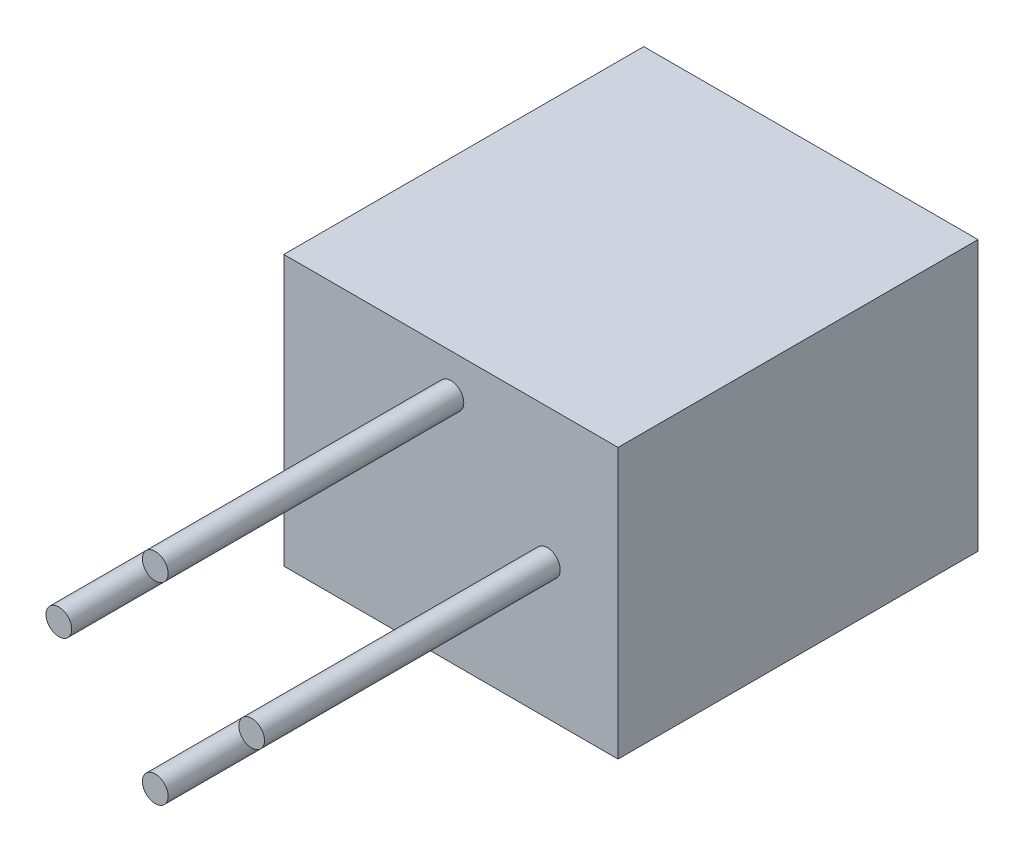
ISO-10303-21;
HEADER;
FILE_DESCRIPTION(('STEP AP214'),'2;1');
FILE_NAME('part.step','',(''),(''),'','','');
FILE_SCHEMA(('AUTOMOTIVE_DESIGN { 1 0 10303 214 1 1 1 1 }'));
ENDSEC;
DATA;
#1=APPLICATION_CONTEXT('core data for automotive mechanical design processes');
#2=APPLICATION_PROTOCOL_DEFINITION('international standard','automotive_design',2000,#1);
#3=PRODUCT_CONTEXT('',#1,'mechanical');
#4=PRODUCT('Part','Part','',(#3));
#5=PRODUCT_RELATED_PRODUCT_CATEGORY('part','',(#4));
#6=PRODUCT_DEFINITION_FORMATION('','',#4);
#7=PRODUCT_DEFINITION_CONTEXT('part definition',#1,'design');
#8=PRODUCT_DEFINITION('design','',#6,#7);
#9=PRODUCT_DEFINITION_SHAPE('','',#8);
#10=(LENGTH_UNIT() NAMED_UNIT(*) SI_UNIT(.MILLI.,.METRE.));
#11=(NAMED_UNIT(*) PLANE_ANGLE_UNIT() SI_UNIT($,.RADIAN.));
#12=(NAMED_UNIT(*) SI_UNIT($,.STERADIAN.) SOLID_ANGLE_UNIT());
#13=UNCERTAINTY_MEASURE_WITH_UNIT(LENGTH_MEASURE(1.E-05),#10,'distance_accuracy_value','');
#14=(GEOMETRIC_REPRESENTATION_CONTEXT(3) GLOBAL_UNCERTAINTY_ASSIGNED_CONTEXT((#13)) GLOBAL_UNIT_ASSIGNED_CONTEXT((#10,
#11,#12)) REPRESENTATION_CONTEXT('',''));
#15=CARTESIAN_POINT('',(0.,0.,0.));
#16=DIRECTION('',(0.,0.,1.));
#17=DIRECTION('',(1.,0.,0.));
#18=AXIS2_PLACEMENT_3D('',#15,#16,#17);
#19=CARTESIAN_POINT('',(-7.99999999999988,10.4999999999997,-25.));
#20=DIRECTION('',(-1.,0.,0.));
#21=DIRECTION('',(0.,0.,1.));
#22=AXIS2_PLACEMENT_3D('',#19,#20,#21);
#23=PLANE('',#22);
#24=DIRECTION('',(0.,0.,1.));
#25=VECTOR('',#24,1.);
#26=CARTESIAN_POINT('',(-7.99999999999988,-10.5000000000003,-25.));
#27=LINE('',#26,#25);
#28=CARTESIAN_POINT('',(-7.99999999999988,-10.5000000000003,-25.));
#29=VERTEX_POINT('',#28);
#30=CARTESIAN_POINT('',(-7.99999999999988,-10.5000000000003,3.));
#31=VERTEX_POINT('',#30);
#32=EDGE_CURVE('E35',#29,#31,#27,.T.);
#33=ORIENTED_EDGE('',*,*,#32,.T.);
#34=DIRECTION('',(0.,-1.,0.));
#35=VECTOR('',#34,1.);
#36=CARTESIAN_POINT('',(-7.99999999999988,10.4999999999997,3.));
#37=LINE('',#36,#35);
#38=CARTESIAN_POINT('',(-7.99999999999988,10.4999999999997,3.));
#39=VERTEX_POINT('',#38);
#40=EDGE_CURVE('E104',#39,#31,#37,.T.);
#41=ORIENTED_EDGE('',*,*,#40,.F.);
#42=DIRECTION('',(0.,0.,1.));
#43=VECTOR('',#42,1.);
#44=CARTESIAN_POINT('',(-7.99999999999988,10.4999999999997,-25.));
#45=LINE('',#44,#43);
#46=CARTESIAN_POINT('',(-7.99999999999988,10.4999999999997,-25.));
#47=VERTEX_POINT('',#46);
#48=EDGE_CURVE('E11',#47,#39,#45,.T.);
#49=ORIENTED_EDGE('',*,*,#48,.F.);
#50=DIRECTION('',(0.,-1.,0.));
#51=VECTOR('',#50,1.);
#52=CARTESIAN_POINT('',(-7.99999999999988,10.4999999999997,-25.));
#53=LINE('',#52,#51);
#54=EDGE_CURVE('E149',#47,#29,#53,.T.);
#55=ORIENTED_EDGE('',*,*,#54,.T.);
#56=EDGE_LOOP('',(#33,#41,#49,#55));
#57=FACE_BOUND('',#56,.T.);
#58=ADVANCED_FACE('F32',(#57),#23,.T.);
#59=CARTESIAN_POINT('',(18.0000000000001,10.4999999999997,-25.));
#60=DIRECTION('',(0.,1.,0.));
#61=DIRECTION('',(0.,0.,1.));
#62=AXIS2_PLACEMENT_3D('',#59,#60,#61);
#63=PLANE('',#62);
#64=ORIENTED_EDGE('',*,*,#48,.T.);
#65=DIRECTION('',(-1.,0.,0.));
#66=VECTOR('',#65,1.);
#67=CARTESIAN_POINT('',(18.0000000000001,10.4999999999997,3.));
#68=LINE('',#67,#66);
#69=CARTESIAN_POINT('',(18.0000000000001,10.4999999999997,3.));
#70=VERTEX_POINT('',#69);
#71=EDGE_CURVE('E100',#70,#39,#68,.T.);
#72=ORIENTED_EDGE('',*,*,#71,.F.);
#73=DIRECTION('',(0.,0.,1.));
#74=VECTOR('',#73,1.);
#75=CARTESIAN_POINT('',(18.0000000000001,10.4999999999997,-25.));
#76=LINE('',#75,#74);
#77=CARTESIAN_POINT('',(18.0000000000001,10.4999999999997,-25.));
#78=VERTEX_POINT('',#77);
#79=EDGE_CURVE('E40',#78,#70,#76,.T.);
#80=ORIENTED_EDGE('',*,*,#79,.F.);
#81=DIRECTION('',(-1.,0.,0.));
#82=VECTOR('',#81,1.);
#83=CARTESIAN_POINT('',(18.0000000000001,10.4999999999997,-25.));
#84=LINE('',#83,#82);
#85=EDGE_CURVE('E102',#78,#47,#84,.T.);
#86=ORIENTED_EDGE('',*,*,#85,.T.);
#87=EDGE_LOOP('',(#64,#72,#80,#86));
#88=FACE_BOUND('',#87,.T.);
#89=ADVANCED_FACE('F98',(#88),#63,.T.);
#90=CARTESIAN_POINT('',(18.0000000000001,-10.5000000000003,-25.));
#91=DIRECTION('',(1.,0.,0.));
#92=DIRECTION('',(0.,0.,-1.));
#93=AXIS2_PLACEMENT_3D('',#90,#91,#92);
#94=PLANE('',#93);
#95=ORIENTED_EDGE('',*,*,#79,.T.);
#96=DIRECTION('',(0.,1.,0.));
#97=VECTOR('',#96,1.);
#98=CARTESIAN_POINT('',(18.0000000000001,-10.5000000000003,3.));
#99=LINE('',#98,#97);
#100=CARTESIAN_POINT('',(18.0000000000001,-10.5000000000003,3.));
#101=VERTEX_POINT('',#100);
#102=EDGE_CURVE('E113',#101,#70,#99,.T.);
#103=ORIENTED_EDGE('',*,*,#102,.F.);
#104=DIRECTION('',(0.,0.,1.));
#105=VECTOR('',#104,1.);
#106=CARTESIAN_POINT('',(18.0000000000001,-10.5000000000003,-25.));
#107=LINE('',#106,#105);
#108=CARTESIAN_POINT('',(18.0000000000001,-10.5000000000003,-25.));
#109=VERTEX_POINT('',#108);
#110=EDGE_CURVE('E165',#109,#101,#107,.T.);
#111=ORIENTED_EDGE('',*,*,#110,.F.);
#112=DIRECTION('',(0.,1.,0.));
#113=VECTOR('',#112,1.);
#114=CARTESIAN_POINT('',(18.0000000000001,-10.5000000000003,-25.));
#115=LINE('',#114,#113);
#116=EDGE_CURVE('E161',#109,#78,#115,.T.);
#117=ORIENTED_EDGE('',*,*,#116,.T.);
#118=EDGE_LOOP('',(#95,#103,#111,#117));
#119=FACE_BOUND('',#118,.T.);
#120=ADVANCED_FACE('F171',(#119),#94,.T.);
#121=CARTESIAN_POINT('',(-7.99999999999988,-10.5000000000003,-25.));
#122=DIRECTION('',(0.,-1.,0.));
#123=DIRECTION('',(0.,0.,-1.));
#124=AXIS2_PLACEMENT_3D('',#121,#122,#123);
#125=PLANE('',#124);
#126=ORIENTED_EDGE('',*,*,#110,.T.);
#127=DIRECTION('',(1.,0.,0.));
#128=VECTOR('',#127,1.);
#129=CARTESIAN_POINT('',(-7.99999999999988,-10.5000000000003,3.));
#130=LINE('',#129,#128);
#131=EDGE_CURVE('E108',#31,#101,#130,.T.);
#132=ORIENTED_EDGE('',*,*,#131,.F.);
#133=ORIENTED_EDGE('',*,*,#32,.F.);
#134=DIRECTION('',(1.,0.,0.));
#135=VECTOR('',#134,1.);
#136=CARTESIAN_POINT('',(-7.99999999999988,-10.5000000000003,-25.));
#137=LINE('',#136,#135);
#138=EDGE_CURVE('E158',#29,#109,#137,.T.);
#139=ORIENTED_EDGE('',*,*,#138,.T.);
#140=EDGE_LOOP('',(#126,#132,#133,#139));
#141=FACE_BOUND('',#140,.T.);
#142=ADVANCED_FACE('F167',(#141),#125,.T.);
#143=CARTESIAN_POINT('',(0.,0.,-25.));
#144=DIRECTION('',(0.,0.,1.));
#145=DIRECTION('',(1.,0.,0.));
#146=AXIS2_PLACEMENT_3D('',#143,#144,#145);
#147=PLANE('',#146);
#148=DIRECTION('',(-1.,0.,0.));
#149=VECTOR('',#148,1.);
#150=CARTESIAN_POINT('',(15.0000000000001,7.49999999999967,-25.));
#151=LINE('',#150,#149);
#152=CARTESIAN_POINT('',(15.0000000000001,7.49999999999967,-25.));
#153=VERTEX_POINT('',#152);
#154=CARTESIAN_POINT('',(-4.99999999999988,7.49999999999967,-25.));
#155=VERTEX_POINT('',#154);
#156=EDGE_CURVE('E132',#153,#155,#151,.T.);
#157=ORIENTED_EDGE('',*,*,#156,.T.);
#158=DIRECTION('',(0.,-1.,0.));
#159=VECTOR('',#158,1.);
#160=CARTESIAN_POINT('',(-4.99999999999988,7.49999999999967,-25.));
#161=LINE('',#160,#159);
#162=CARTESIAN_POINT('',(-4.99999999999989,-7.50000000000033,-25.));
#163=VERTEX_POINT('',#162);
#164=EDGE_CURVE('E124',#155,#163,#161,.T.);
#165=ORIENTED_EDGE('',*,*,#164,.T.);
#166=DIRECTION('',(1.,0.,0.));
#167=VECTOR('',#166,1.);
#168=CARTESIAN_POINT('',(-4.99999999999989,-7.50000000000033,-25.));
#169=LINE('',#168,#167);
#170=CARTESIAN_POINT('',(15.0000000000001,-7.50000000000033,-25.));
#171=VERTEX_POINT('',#170);
#172=EDGE_CURVE('E127',#163,#171,#169,.T.);
#173=ORIENTED_EDGE('',*,*,#172,.T.);
#174=DIRECTION('',(0.,1.,0.));
#175=VECTOR('',#174,1.);
#176=CARTESIAN_POINT('',(15.0000000000001,-7.50000000000033,-25.));
#177=LINE('',#176,#175);
#178=EDGE_CURVE('E48',#171,#153,#177,.T.);
#179=ORIENTED_EDGE('',*,*,#178,.T.);
#180=EDGE_LOOP('',(#157,#165,#173,#179));
#181=FACE_BOUND('',#180,.T.);
#182=ORIENTED_EDGE('',*,*,#54,.F.);
#183=ORIENTED_EDGE('',*,*,#85,.F.);
#184=ORIENTED_EDGE('',*,*,#116,.F.);
#185=ORIENTED_EDGE('',*,*,#138,.F.);
#186=EDGE_LOOP('',(#182,#183,#184,#185));
#187=FACE_BOUND('',#186,.T.);
#188=ADVANCED_FACE('F173',(#181,#187),#147,.F.);
#189=CARTESIAN_POINT('',(-4.99999999999988,7.49999999999967,-25.));
#190=DIRECTION('',(-1.,0.,0.));
#191=DIRECTION('',(0.,-1.,0.));
#192=AXIS2_PLACEMENT_3D('',#189,#190,#191);
#193=PLANE('',#192);
#194=DIRECTION('',(0.,-1.,0.));
#195=VECTOR('',#194,1.);
#196=CARTESIAN_POINT('',(-4.99999999999988,7.49999999999967,0.));
#197=LINE('',#196,#195);
#198=CARTESIAN_POINT('',(-4.99999999999988,7.49999999999967,0.));
#199=VERTEX_POINT('',#198);
#200=CARTESIAN_POINT('',(-4.99999999999989,-7.50000000000033,0.));
#201=VERTEX_POINT('',#200);
#202=EDGE_CURVE('E123',#199,#201,#197,.T.);
#203=ORIENTED_EDGE('',*,*,#202,.T.);
#204=DIRECTION('',(0.,0.,1.));
#205=VECTOR('',#204,1.);
#206=CARTESIAN_POINT('',(-4.99999999999989,-7.50000000000033,-25.));
#207=LINE('',#206,#205);
#208=EDGE_CURVE('E135',#163,#201,#207,.T.);
#209=ORIENTED_EDGE('',*,*,#208,.F.);
#210=ORIENTED_EDGE('',*,*,#164,.F.);
#211=DIRECTION('',(0.,0.,1.));
#212=VECTOR('',#211,1.);
#213=CARTESIAN_POINT('',(-4.99999999999988,7.49999999999967,-25.));
#214=LINE('',#213,#212);
#215=EDGE_CURVE('E146',#155,#199,#214,.T.);
#216=ORIENTED_EDGE('',*,*,#215,.T.);
#217=EDGE_LOOP('',(#203,#209,#210,#216));
#218=FACE_BOUND('',#217,.T.);
#219=ADVANCED_FACE('F175',(#218),#193,.F.);
#220=CARTESIAN_POINT('',(15.0000000000001,7.49999999999967,-25.));
#221=DIRECTION('',(0.,1.,0.));
#222=DIRECTION('',(-1.,0.,0.));
#223=AXIS2_PLACEMENT_3D('',#220,#221,#222);
#224=PLANE('',#223);
#225=DIRECTION('',(-1.,0.,0.));
#226=VECTOR('',#225,1.);
#227=CARTESIAN_POINT('',(15.0000000000001,7.49999999999967,0.));
#228=LINE('',#227,#226);
#229=CARTESIAN_POINT('',(15.0000000000001,7.49999999999967,0.));
#230=VERTEX_POINT('',#229);
#231=EDGE_CURVE('E128',#230,#199,#228,.T.);
#232=ORIENTED_EDGE('',*,*,#231,.T.);
#233=ORIENTED_EDGE('',*,*,#215,.F.);
#234=ORIENTED_EDGE('',*,*,#156,.F.);
#235=DIRECTION('',(0.,0.,1.));
#236=VECTOR('',#235,1.);
#237=CARTESIAN_POINT('',(15.0000000000001,7.49999999999967,-25.));
#238=LINE('',#237,#236);
#239=EDGE_CURVE('E150',#153,#230,#238,.T.);
#240=ORIENTED_EDGE('',*,*,#239,.T.);
#241=EDGE_LOOP('',(#232,#233,#234,#240));
#242=FACE_BOUND('',#241,.T.);
#243=ADVANCED_FACE('F182',(#242),#224,.F.);
#244=CARTESIAN_POINT('',(15.0000000000001,-7.50000000000033,-25.));
#245=DIRECTION('',(1.,0.,0.));
#246=DIRECTION('',(0.,1.,0.));
#247=AXIS2_PLACEMENT_3D('',#244,#245,#246);
#248=PLANE('',#247);
#249=DIRECTION('',(0.,1.,0.));
#250=VECTOR('',#249,1.);
#251=CARTESIAN_POINT('',(15.0000000000001,-7.50000000000033,0.));
#252=LINE('',#251,#250);
#253=CARTESIAN_POINT('',(15.0000000000001,-7.50000000000033,0.));
#254=VERTEX_POINT('',#253);
#255=EDGE_CURVE('E141',#254,#230,#252,.T.);
#256=ORIENTED_EDGE('',*,*,#255,.T.);
#257=ORIENTED_EDGE('',*,*,#239,.F.);
#258=ORIENTED_EDGE('',*,*,#178,.F.);
#259=DIRECTION('',(0.,0.,1.));
#260=VECTOR('',#259,1.);
#261=CARTESIAN_POINT('',(15.0000000000001,-7.50000000000033,-25.));
#262=LINE('',#261,#260);
#263=EDGE_CURVE('E153',#171,#254,#262,.T.);
#264=ORIENTED_EDGE('',*,*,#263,.T.);
#265=EDGE_LOOP('',(#256,#257,#258,#264));
#266=FACE_BOUND('',#265,.T.);
#267=ADVANCED_FACE('F218',(#266),#248,.F.);
#268=CARTESIAN_POINT('',(-4.99999999999989,-7.50000000000033,-25.));
#269=DIRECTION('',(0.,-1.,0.));
#270=DIRECTION('',(1.,0.,0.));
#271=AXIS2_PLACEMENT_3D('',#268,#269,#270);
#272=PLANE('',#271);
#273=DIRECTION('',(1.,0.,0.));
#274=VECTOR('',#273,1.);
#275=CARTESIAN_POINT('',(-4.99999999999989,-7.50000000000033,0.));
#276=LINE('',#275,#274);
#277=EDGE_CURVE('E138',#201,#254,#276,.T.);
#278=ORIENTED_EDGE('',*,*,#277,.T.);
#279=ORIENTED_EDGE('',*,*,#263,.F.);
#280=ORIENTED_EDGE('',*,*,#172,.F.);
#281=ORIENTED_EDGE('',*,*,#208,.T.);
#282=EDGE_LOOP('',(#278,#279,#280,#281));
#283=FACE_BOUND('',#282,.T.);
#284=ADVANCED_FACE('F228',(#283),#272,.F.);
#285=CARTESIAN_POINT('',(0.,0.,0.));
#286=DIRECTION('',(0.,0.,1.));
#287=DIRECTION('',(1.,0.,0.));
#288=AXIS2_PLACEMENT_3D('',#285,#286,#287);
#289=PLANE('',#288);
#290=ORIENTED_EDGE('',*,*,#202,.F.);
#291=ORIENTED_EDGE('',*,*,#231,.F.);
#292=ORIENTED_EDGE('',*,*,#255,.F.);
#293=ORIENTED_EDGE('',*,*,#277,.F.);
#294=EDGE_LOOP('',(#290,#291,#292,#293));
#295=FACE_BOUND('',#294,.T.);
#296=ADVANCED_FACE('F237',(#295),#289,.F.);
#297=CARTESIAN_POINT('',(0.,0.,3.));
#298=DIRECTION('',(0.,0.,1.));
#299=DIRECTION('',(1.,0.,0.));
#300=AXIS2_PLACEMENT_3D('',#297,#298,#299);
#301=PLANE('',#300);
#302=CARTESIAN_POINT('',(5.00000000000019,7.49999999999967,3.));
#303=DIRECTION('',(0.,0.,1.));
#304=DIRECTION('',(1.,0.,0.));
#305=AXIS2_PLACEMENT_3D('',#302,#303,#304);
#306=CIRCLE('',#305,1.);
#307=CARTESIAN_POINT('',(6.0000000000002,7.49999999999967,3.));
#308=VERTEX_POINT('',#307);
#309=EDGE_CURVE('E344',#308,#308,#306,.T.);
#310=ORIENTED_EDGE('',*,*,#309,.F.);
#311=EDGE_LOOP('',(#310));
#312=FACE_BOUND('',#311,.T.);
#313=CARTESIAN_POINT('',(-2.49999999999989,-2.77122993630202E-13,3.));
#314=DIRECTION('',(0.,0.,1.));
#315=DIRECTION('',(1.,0.,0.));
#316=AXIS2_PLACEMENT_3D('',#313,#314,#315);
#317=CIRCLE('',#316,1.);
#318=CARTESIAN_POINT('',(-1.49999999999989,-2.77122993630202E-13,3.));
#319=VERTEX_POINT('',#318);
#320=EDGE_CURVE('E343',#319,#319,#317,.T.);
#321=ORIENTED_EDGE('',*,*,#320,.F.);
#322=EDGE_LOOP('',(#321));
#323=FACE_BOUND('',#322,.T.);
#324=CARTESIAN_POINT('',(5.00000000000009,-7.50000000000033,3.));
#325=DIRECTION('',(0.,0.,1.));
#326=DIRECTION('',(1.,0.,0.));
#327=AXIS2_PLACEMENT_3D('',#324,#325,#326);
#328=CIRCLE('',#327,1.);
#329=CARTESIAN_POINT('',(6.00000000000009,-7.50000000000033,3.));
#330=VERTEX_POINT('',#329);
#331=EDGE_CURVE('E353',#330,#330,#328,.T.);
#332=ORIENTED_EDGE('',*,*,#331,.F.);
#333=EDGE_LOOP('',(#332));
#334=FACE_BOUND('',#333,.T.);
#335=CARTESIAN_POINT('',(12.5000000000001,-3.3133218391157E-13,3.));
#336=DIRECTION('',(0.,0.,1.));
#337=DIRECTION('',(1.,0.,0.));
#338=AXIS2_PLACEMENT_3D('',#335,#336,#337);
#339=CIRCLE('',#338,1.);
#340=CARTESIAN_POINT('',(13.5000000000001,-3.3133218391157E-13,3.));
#341=VERTEX_POINT('',#340);
#342=EDGE_CURVE('E117',#341,#341,#339,.T.);
#343=ORIENTED_EDGE('',*,*,#342,.F.);
#344=EDGE_LOOP('',(#343));
#345=FACE_BOUND('',#344,.T.);
#346=ORIENTED_EDGE('',*,*,#71,.T.);
#347=ORIENTED_EDGE('',*,*,#40,.T.);
#348=ORIENTED_EDGE('',*,*,#131,.T.);
#349=ORIENTED_EDGE('',*,*,#102,.T.);
#350=EDGE_LOOP('',(#346,#347,#348,#349));
#351=FACE_BOUND('',#350,.T.);
#352=ADVANCED_FACE('F111',(#312,#323,#334,#345,#351),#301,.T.);
#353=CARTESIAN_POINT('',(12.5000000000001,-3.3133218391157E-13,26.));
#354=DIRECTION('',(0.,0.,-1.));
#355=DIRECTION('',(-1.,0.,0.));
#356=AXIS2_PLACEMENT_3D('',#353,#354,#355);
#357=CYLINDRICAL_SURFACE('',#356,1.);
#358=CARTESIAN_POINT('',(12.5000000000001,-3.3133218391157E-13,26.));
#359=DIRECTION('',(0.,0.,1.));
#360=DIRECTION('',(1.,0.,0.));
#361=AXIS2_PLACEMENT_3D('',#358,#359,#360);
#362=CIRCLE('',#361,1.);
#363=CARTESIAN_POINT('',(13.5000000000001,-3.3133218391157E-13,26.));
#364=VERTEX_POINT('',#363);
#365=EDGE_CURVE('E114',#364,#364,#362,.T.);
#366=ORIENTED_EDGE('',*,*,#365,.F.);
#367=EDGE_LOOP('',(#366));
#368=FACE_BOUND('',#367,.T.);
#369=ORIENTED_EDGE('',*,*,#342,.T.);
#370=EDGE_LOOP('',(#369));
#371=FACE_BOUND('',#370,.T.);
#372=ADVANCED_FACE('F256',(#368,#371),#357,.T.);
#373=CARTESIAN_POINT('',(12.5000000000001,-3.3133218391157E-13,26.));
#374=DIRECTION('',(0.,0.,1.));
#375=DIRECTION('',(1.,0.,0.));
#376=AXIS2_PLACEMENT_3D('',#373,#374,#375);
#377=PLANE('',#376);
#378=ORIENTED_EDGE('',*,*,#365,.T.);
#379=EDGE_LOOP('',(#378));
#380=FACE_BOUND('',#379,.T.);
#381=ADVANCED_FACE('F266',(#380),#377,.T.);
#382=CARTESIAN_POINT('',(5.00000000000009,-7.50000000000033,26.));
#383=DIRECTION('',(0.,0.,-1.));
#384=DIRECTION('',(-1.,0.,0.));
#385=AXIS2_PLACEMENT_3D('',#382,#383,#384);
#386=CYLINDRICAL_SURFACE('',#385,1.);
#387=CARTESIAN_POINT('',(5.00000000000009,-7.50000000000033,26.));
#388=DIRECTION('',(0.,0.,1.));
#389=DIRECTION('',(1.,0.,0.));
#390=AXIS2_PLACEMENT_3D('',#387,#388,#389);
#391=CIRCLE('',#390,1.);
#392=CARTESIAN_POINT('',(6.00000000000009,-7.50000000000033,26.));
#393=VERTEX_POINT('',#392);
#394=EDGE_CURVE('E355',#393,#393,#391,.T.);
#395=ORIENTED_EDGE('',*,*,#394,.F.);
#396=EDGE_LOOP('',(#395));
#397=FACE_BOUND('',#396,.T.);
#398=ORIENTED_EDGE('',*,*,#331,.T.);
#399=EDGE_LOOP('',(#398));
#400=FACE_BOUND('',#399,.T.);
#401=ADVANCED_FACE('F276',(#397,#400),#386,.T.);
#402=CARTESIAN_POINT('',(5.00000000000009,-7.50000000000033,26.));
#403=DIRECTION('',(0.,0.,1.));
#404=DIRECTION('',(1.,0.,0.));
#405=AXIS2_PLACEMENT_3D('',#402,#403,#404);
#406=PLANE('',#405);
#407=ORIENTED_EDGE('',*,*,#394,.T.);
#408=EDGE_LOOP('',(#407));
#409=FACE_BOUND('',#408,.T.);
#410=ADVANCED_FACE('F286',(#409),#406,.T.);
#411=CARTESIAN_POINT('',(-2.49999999999989,-2.77122993630202E-13,26.));
#412=DIRECTION('',(0.,0.,-1.));
#413=DIRECTION('',(-1.,0.,0.));
#414=AXIS2_PLACEMENT_3D('',#411,#412,#413);
#415=CYLINDRICAL_SURFACE('',#414,1.);
#416=CARTESIAN_POINT('',(-2.49999999999989,-2.77122993630202E-13,26.));
#417=DIRECTION('',(0.,0.,1.));
#418=DIRECTION('',(1.,0.,0.));
#419=AXIS2_PLACEMENT_3D('',#416,#417,#418);
#420=CIRCLE('',#419,1.);
#421=CARTESIAN_POINT('',(-1.49999999999989,-2.77122993630202E-13,26.));
#422=VERTEX_POINT('',#421);
#423=EDGE_CURVE('E347',#422,#422,#420,.T.);
#424=ORIENTED_EDGE('',*,*,#423,.F.);
#425=EDGE_LOOP('',(#424));
#426=FACE_BOUND('',#425,.T.);
#427=ORIENTED_EDGE('',*,*,#320,.T.);
#428=EDGE_LOOP('',(#427));
#429=FACE_BOUND('',#428,.T.);
#430=ADVANCED_FACE('F296',(#426,#429),#415,.T.);
#431=CARTESIAN_POINT('',(-2.49999999999989,-2.77122993630202E-13,26.));
#432=DIRECTION('',(0.,0.,1.));
#433=DIRECTION('',(1.,0.,0.));
#434=AXIS2_PLACEMENT_3D('',#431,#432,#433);
#435=PLANE('',#434);
#436=ORIENTED_EDGE('',*,*,#423,.T.);
#437=EDGE_LOOP('',(#436));
#438=FACE_BOUND('',#437,.T.);
#439=ADVANCED_FACE('F306',(#438),#435,.T.);
#440=CARTESIAN_POINT('',(5.00000000000019,7.49999999999967,26.));
#441=DIRECTION('',(0.,0.,-1.));
#442=DIRECTION('',(-1.,0.,0.));
#443=AXIS2_PLACEMENT_3D('',#440,#441,#442);
#444=CYLINDRICAL_SURFACE('',#443,1.);
#445=CARTESIAN_POINT('',(5.00000000000019,7.49999999999967,26.));
#446=DIRECTION('',(0.,0.,1.));
#447=DIRECTION('',(1.,0.,0.));
#448=AXIS2_PLACEMENT_3D('',#445,#446,#447);
#449=CIRCLE('',#448,1.);
#450=CARTESIAN_POINT('',(6.0000000000002,7.49999999999967,26.));
#451=VERTEX_POINT('',#450);
#452=EDGE_CURVE('E342',#451,#451,#449,.T.);
#453=ORIENTED_EDGE('',*,*,#452,.F.);
#454=EDGE_LOOP('',(#453));
#455=FACE_BOUND('',#454,.T.);
#456=ORIENTED_EDGE('',*,*,#309,.T.);
#457=EDGE_LOOP('',(#456));
#458=FACE_BOUND('',#457,.T.);
#459=ADVANCED_FACE('F316',(#455,#458),#444,.T.);
#460=CARTESIAN_POINT('',(5.00000000000019,7.49999999999967,26.));
#461=DIRECTION('',(0.,0.,1.));
#462=DIRECTION('',(1.,0.,0.));
#463=AXIS2_PLACEMENT_3D('',#460,#461,#462);
#464=PLANE('',#463);
#465=ORIENTED_EDGE('',*,*,#452,.T.);
#466=EDGE_LOOP('',(#465));
#467=FACE_BOUND('',#466,.T.);
#468=ADVANCED_FACE('F326',(#467),#464,.T.);
#469=CLOSED_SHELL('',(#58,#89,#120,#142,#188,#219,#243,#267,#284,#296,#352,#372,#381,#401,#410,
#430,#439,#459,#468));
#470=MANIFOLD_SOLID_BREP('B2',#469);
#471=ADVANCED_BREP_SHAPE_REPRESENTATION('',(#18,#470),#14);
#472=SHAPE_DEFINITION_REPRESENTATION(#9,#471);
ENDSEC;
END-ISO-10303-21;
